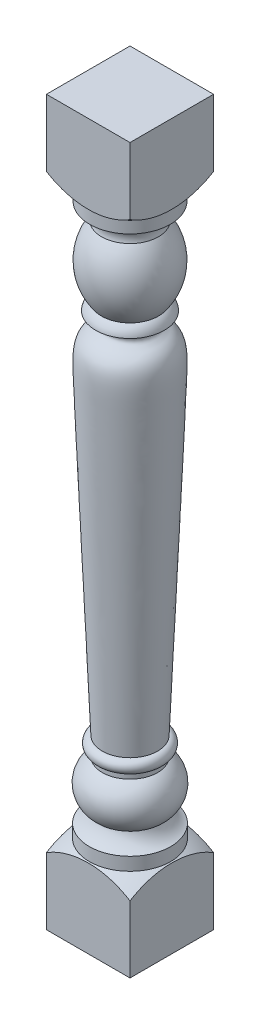
ISO-10303-21;
HEADER;
FILE_DESCRIPTION(('STEP AP214'),'2;1');
FILE_NAME('part.step','',(''),(''),'','','');
FILE_SCHEMA(('AUTOMOTIVE_DESIGN { 1 0 10303 214 1 1 1 1 }'));
ENDSEC;
DATA;
#1=APPLICATION_CONTEXT('core data for automotive mechanical design processes');
#2=APPLICATION_PROTOCOL_DEFINITION('international standard','automotive_design',2000,#1);
#3=PRODUCT_CONTEXT('',#1,'mechanical');
#4=PRODUCT('Part','Part','',(#3));
#5=PRODUCT_RELATED_PRODUCT_CATEGORY('part','',(#4));
#6=PRODUCT_DEFINITION_FORMATION('','',#4);
#7=PRODUCT_DEFINITION_CONTEXT('part definition',#1,'design');
#8=PRODUCT_DEFINITION('design','',#6,#7);
#9=PRODUCT_DEFINITION_SHAPE('','',#8);
#10=(LENGTH_UNIT() NAMED_UNIT(*) SI_UNIT(.MILLI.,.METRE.));
#11=(NAMED_UNIT(*) PLANE_ANGLE_UNIT() SI_UNIT($,.RADIAN.));
#12=(NAMED_UNIT(*) SI_UNIT($,.STERADIAN.) SOLID_ANGLE_UNIT());
#13=UNCERTAINTY_MEASURE_WITH_UNIT(LENGTH_MEASURE(1.E-05),#10,'distance_accuracy_value','');
#14=(GEOMETRIC_REPRESENTATION_CONTEXT(3) GLOBAL_UNCERTAINTY_ASSIGNED_CONTEXT((#13)) GLOBAL_UNIT_ASSIGNED_CONTEXT((#10,
#11,#12)) REPRESENTATION_CONTEXT('',''));
#15=CARTESIAN_POINT('',(0.,0.,0.));
#16=DIRECTION('',(0.,0.,1.));
#17=DIRECTION('',(1.,0.,0.));
#18=AXIS2_PLACEMENT_3D('',#15,#16,#17);
#19=CARTESIAN_POINT('',(28.575,440.454839025049,0.));
#20=DIRECTION('',(0.,-1.,0.));
#21=DIRECTION('',(-1.,0.,0.));
#22=AXIS2_PLACEMENT_3D('',#19,#20,#21);
#23=SPHERICAL_SURFACE('',#22,60.96);
#24=CARTESIAN_POINT('',(28.575,386.08,0.));
#25=DIRECTION('',(0.,-1.,0.));
#26=DIRECTION('',(0.,0.,-1.));
#27=AXIS2_PLACEMENT_3D('',#24,#25,#26);
#28=CIRCLE('',#27,27.559);
#29=CARTESIAN_POINT('',(28.575,386.08,-27.559));
#30=VERTEX_POINT('',#29);
#31=EDGE_CURVE('E225',#30,#30,#28,.T.);
#32=ORIENTED_EDGE('',*,*,#31,.F.);
#33=EDGE_LOOP('',(#32));
#34=FACE_BOUND('',#33,.T.);
#35=CARTESIAN_POINT('',(0.,440.454839025049,0.));
#36=DIRECTION('',(-1.,0.,0.));
#37=DIRECTION('',(0.,0.,1.));
#38=AXIS2_PLACEMENT_3D('',#35,#36,#37);
#39=CIRCLE('',#38,53.8478502356408);
#40=CARTESIAN_POINT('',(0.,394.81428304684,-28.575));
#41=VERTEX_POINT('',#40);
#42=CARTESIAN_POINT('',(0.,394.81428304684,28.575));
#43=VERTEX_POINT('',#42);
#44=EDGE_CURVE('E108',#41,#43,#39,.T.);
#45=ORIENTED_EDGE('',*,*,#44,.F.);
#46=CARTESIAN_POINT('',(28.575,440.454839025049,-28.575));
#47=DIRECTION('',(0.,0.,-1.));
#48=DIRECTION('',(-1.,0.,0.));
#49=AXIS2_PLACEMENT_3D('',#46,#47,#48);
#50=CIRCLE('',#49,53.8478502356408);
#51=CARTESIAN_POINT('',(57.15,394.81428304684,-28.575));
#52=VERTEX_POINT('',#51);
#53=EDGE_CURVE('E150',#52,#41,#50,.T.);
#54=ORIENTED_EDGE('',*,*,#53,.F.);
#55=CARTESIAN_POINT('',(57.15,440.454839025049,0.));
#56=DIRECTION('',(1.,0.,0.));
#57=DIRECTION('',(0.,0.,-1.));
#58=AXIS2_PLACEMENT_3D('',#55,#56,#57);
#59=CIRCLE('',#58,53.8478502356408);
#60=CARTESIAN_POINT('',(57.15,394.81428304684,28.575));
#61=VERTEX_POINT('',#60);
#62=EDGE_CURVE('E148',#61,#52,#59,.T.);
#63=ORIENTED_EDGE('',*,*,#62,.F.);
#64=CARTESIAN_POINT('',(28.575,440.454839025049,28.575));
#65=DIRECTION('',(0.,0.,1.));
#66=DIRECTION('',(1.,0.,0.));
#67=AXIS2_PLACEMENT_3D('',#64,#65,#66);
#68=CIRCLE('',#67,53.8478502356408);
#69=EDGE_CURVE('E139',#43,#61,#68,.T.);
#70=ORIENTED_EDGE('',*,*,#69,.F.);
#71=EDGE_LOOP('',(#45,#54,#63,#70));
#72=FACE_BOUND('',#71,.T.);
#73=ADVANCED_FACE('F34',(#34,#72),#23,.T.);
#74=CARTESIAN_POINT('',(28.575,-54.2453558472981,0.));
#75=DIRECTION('',(0.,-1.,0.));
#76=DIRECTION('',(-1.,0.,0.));
#77=AXIS2_PLACEMENT_3D('',#74,#75,#76);
#78=SPHERICAL_SURFACE('',#77,60.96);
#79=CARTESIAN_POINT('',(28.575,0.,0.));
#80=DIRECTION('',(0.,-1.,0.));
#81=DIRECTION('',(0.,0.,-1.));
#82=AXIS2_PLACEMENT_3D('',#79,#80,#81);
#83=CIRCLE('',#82,27.813);
#84=CARTESIAN_POINT('',(28.575,0.,-27.813));
#85=VERTEX_POINT('',#84);
#86=EDGE_CURVE('E153',#85,#85,#83,.T.);
#87=ORIENTED_EDGE('',*,*,#86,.T.);
#88=EDGE_LOOP('',(#87));
#89=FACE_BOUND('',#88,.T.);
#90=CARTESIAN_POINT('',(0.,-54.2453558472981,0.));
#91=DIRECTION('',(-1.,0.,0.));
#92=DIRECTION('',(0.,0.,1.));
#93=AXIS2_PLACEMENT_3D('',#90,#91,#92);
#94=CIRCLE('',#93,53.8478502356408);
#95=CARTESIAN_POINT('',(0.,-8.60479986908943,28.575));
#96=VERTEX_POINT('',#95);
#97=CARTESIAN_POINT('',(0.,-8.60479986908943,-28.575));
#98=VERTEX_POINT('',#97);
#99=EDGE_CURVE('E12',#96,#98,#94,.T.);
#100=ORIENTED_EDGE('',*,*,#99,.F.);
#101=CARTESIAN_POINT('',(28.575,-54.2453558472981,28.575));
#102=DIRECTION('',(0.,0.,1.));
#103=DIRECTION('',(1.,0.,0.));
#104=AXIS2_PLACEMENT_3D('',#101,#102,#103);
#105=CIRCLE('',#104,53.8478502356408);
#106=CARTESIAN_POINT('',(57.15,-8.60479986908941,28.575));
#107=VERTEX_POINT('',#106);
#108=EDGE_CURVE('E218',#107,#96,#105,.T.);
#109=ORIENTED_EDGE('',*,*,#108,.F.);
#110=CARTESIAN_POINT('',(57.15,-54.2453558472981,0.));
#111=DIRECTION('',(1.,0.,0.));
#112=DIRECTION('',(0.,0.,-1.));
#113=AXIS2_PLACEMENT_3D('',#110,#111,#112);
#114=CIRCLE('',#113,53.8478502356408);
#115=CARTESIAN_POINT('',(57.15,-8.60479986908941,-28.575));
#116=VERTEX_POINT('',#115);
#117=EDGE_CURVE('E224',#116,#107,#114,.T.);
#118=ORIENTED_EDGE('',*,*,#117,.F.);
#119=CARTESIAN_POINT('',(28.575,-54.2453558472981,-28.575));
#120=DIRECTION('',(0.,0.,-1.));
#121=DIRECTION('',(-1.,0.,0.));
#122=AXIS2_PLACEMENT_3D('',#119,#120,#121);
#123=CIRCLE('',#122,53.8478502356408);
#124=EDGE_CURVE('E42',#98,#116,#123,.T.);
#125=ORIENTED_EDGE('',*,*,#124,.F.);
#126=EDGE_LOOP('',(#100,#109,#118,#125));
#127=FACE_BOUND('',#126,.T.);
#128=ADVANCED_FACE('F185',(#89,#127),#78,.T.);
#129=CARTESIAN_POINT('',(28.575,-54.2453558472981,0.));
#130=DIRECTION('',(0.,-1.,0.));
#131=DIRECTION('',(0.,0.,-1.));
#132=AXIS2_PLACEMENT_3D('',#129,#130,#131);
#133=CYLINDRICAL_SURFACE('',#132,27.559);
#134=CARTESIAN_POINT('',(28.575,377.19,0.));
#135=DIRECTION('',(0.,-1.,0.));
#136=DIRECTION('',(0.,0.,-1.));
#137=AXIS2_PLACEMENT_3D('',#134,#135,#136);
#138=CIRCLE('',#137,27.559);
#139=CARTESIAN_POINT('',(28.575,377.19,-27.559));
#140=VERTEX_POINT('',#139);
#141=EDGE_CURVE('E234',#140,#140,#138,.T.);
#142=ORIENTED_EDGE('',*,*,#141,.F.);
#143=EDGE_LOOP('',(#142));
#144=FACE_BOUND('',#143,.T.);
#145=ORIENTED_EDGE('',*,*,#31,.T.);
#146=EDGE_LOOP('',(#145));
#147=FACE_BOUND('',#146,.T.);
#148=ADVANCED_FACE('F181',(#144,#147),#133,.T.);
#149=CARTESIAN_POINT('',(28.575,368.419921422933,0.));
#150=DIRECTION('',(0.,-1.,0.));
#151=DIRECTION('',(0.,0.,-1.));
#152=AXIS2_PLACEMENT_3D('',#149,#150,#151);
#153=TOROIDAL_SURFACE('',#152,27.7912042490007,8.77315205961843);
#154=CARTESIAN_POINT('',(28.575,365.76,0.));
#155=DIRECTION('',(0.,-1.,0.));
#156=DIRECTION('',(0.,0.,-1.));
#157=AXIS2_PLACEMENT_3D('',#154,#155,#156);
#158=CIRCLE('',#157,19.431);
#159=CARTESIAN_POINT('',(28.575,365.76,-19.431));
#160=VERTEX_POINT('',#159);
#161=EDGE_CURVE('E237',#160,#160,#158,.T.);
#162=ORIENTED_EDGE('',*,*,#161,.F.);
#163=EDGE_LOOP('',(#162));
#164=FACE_BOUND('',#163,.T.);
#165=ORIENTED_EDGE('',*,*,#141,.T.);
#166=EDGE_LOOP('',(#165));
#167=FACE_BOUND('',#166,.T.);
#168=ADVANCED_FACE('F177',(#164,#167),#153,.F.);
#169=CARTESIAN_POINT('',(28.575,342.265,0.));
#170=DIRECTION('',(0.,-1.,0.));
#171=DIRECTION('',(0.,0.,-1.));
#172=AXIS2_PLACEMENT_3D('',#169,#170,#171);
#173=DEGENERATE_TOROIDAL_SURFACE('',#172,10.4626171875,38.0216171875,.F.);
#174=CARTESIAN_POINT('',(28.575,318.77,0.));
#175=DIRECTION('',(0.,-1.,0.));
#176=DIRECTION('',(0.,0.,-1.));
#177=AXIS2_PLACEMENT_3D('',#174,#175,#176);
#178=CIRCLE('',#177,19.431);
#179=CARTESIAN_POINT('',(28.575,318.77,-19.431));
#180=VERTEX_POINT('',#179);
#181=EDGE_CURVE('E240',#180,#180,#178,.T.);
#182=ORIENTED_EDGE('',*,*,#181,.F.);
#183=EDGE_LOOP('',(#182));
#184=FACE_BOUND('',#183,.T.);
#185=ORIENTED_EDGE('',*,*,#161,.T.);
#186=EDGE_LOOP('',(#185));
#187=FACE_BOUND('',#186,.T.);
#188=ADVANCED_FACE('F173',(#184,#187),#173,.F.);
#189=CARTESIAN_POINT('',(28.575,310.959588443046,0.));
#190=DIRECTION('',(0.,-1.,0.));
#191=DIRECTION('',(0.,0.,-1.));
#192=AXIS2_PLACEMENT_3D('',#189,#190,#191);
#193=TOROIDAL_SURFACE('',#192,14.2201694422586,9.38910452548592);
#194=CARTESIAN_POINT('',(28.575,312.42,0.));
#195=DIRECTION('',(0.,-1.,0.));
#196=DIRECTION('',(0.,0.,-1.));
#197=AXIS2_PLACEMENT_3D('',#194,#195,#196);
#198=CIRCLE('',#197,23.495);
#199=CARTESIAN_POINT('',(28.575,312.42,-23.495));
#200=VERTEX_POINT('',#199);
#201=EDGE_CURVE('E243',#200,#200,#198,.T.);
#202=ORIENTED_EDGE('',*,*,#201,.F.);
#203=EDGE_LOOP('',(#202));
#204=FACE_BOUND('',#203,.T.);
#205=ORIENTED_EDGE('',*,*,#181,.T.);
#206=EDGE_LOOP('',(#205));
#207=FACE_BOUND('',#206,.T.);
#208=ADVANCED_FACE('F168',(#204,#207),#193,.T.);
#209=CARTESIAN_POINT('',(5.08,312.42,0.));
#210=CARTESIAN_POINT('',(11.4173104349946,311.284997649983,0.));
#211=CARTESIAN_POINT('',(17.3025091797406,300.276086085036,0.));
#212=CARTESIAN_POINT('',(-0.0140903200730887,303.205135197512,0.));
#213=CARTESIAN_POINT('',(2.6345277204096,233.901475667216,0.));
#214=CARTESIAN_POINT('',(1.87324470973118,250.606936673313,0.));
#215=CARTESIAN_POINT('',(9.65200000000001,60.9599999999998,0.));
#216=B_SPLINE_CURVE_WITH_KNOTS('',3,(#209,#210,#211,#212,#213,#214,#215),.UNSPECIFIED.,.F.,.F.,
(4,1,1,1,4),(0.,0.117084259686259,0.342939455018495,0.431231029049869,1.),.UNSPECIFIED.);
#217=CARTESIAN_POINT('',(28.575,-54.2453558472981,0.));
#218=DIRECTION('',(0.,-1.,0.));
#219=AXIS1_PLACEMENT('',#217,#218);
#220=SURFACE_OF_REVOLUTION('',#216,#219);
#221=CARTESIAN_POINT('',(28.575,60.9599999999998,0.));
#222=DIRECTION('',(0.,-1.,0.));
#223=DIRECTION('',(0.,0.,-1.));
#224=AXIS2_PLACEMENT_3D('',#221,#222,#223);
#225=CIRCLE('',#224,18.923);
#226=CARTESIAN_POINT('',(28.575,60.9599999999998,-18.923));
#227=VERTEX_POINT('',#226);
#228=EDGE_CURVE('E246',#227,#227,#225,.T.);
#229=ORIENTED_EDGE('',*,*,#228,.F.);
#230=EDGE_LOOP('',(#229));
#231=FACE_BOUND('',#230,.T.);
#232=ORIENTED_EDGE('',*,*,#201,.T.);
#233=EDGE_LOOP('',(#232));
#234=FACE_BOUND('',#233,.T.);
#235=ADVANCED_FACE('F163',(#231,#234),#220,.T.);
#236=CARTESIAN_POINT('',(28.575,56.515,0.));
#237=DIRECTION('',(0.,-1.,0.));
#238=DIRECTION('',(0.,0.,-1.));
#239=AXIS2_PLACEMENT_3D('',#236,#237,#238);
#240=TOROIDAL_SURFACE('',#239,18.524140625,4.462859375);
#241=CARTESIAN_POINT('',(28.575,52.07,0.));
#242=DIRECTION('',(0.,-1.,0.));
#243=DIRECTION('',(0.,0.,-1.));
#244=AXIS2_PLACEMENT_3D('',#241,#242,#243);
#245=CIRCLE('',#244,18.923);
#246=CARTESIAN_POINT('',(28.575,52.07,-18.923));
#247=VERTEX_POINT('',#246);
#248=EDGE_CURVE('E249',#247,#247,#245,.T.);
#249=ORIENTED_EDGE('',*,*,#248,.F.);
#250=EDGE_LOOP('',(#249));
#251=FACE_BOUND('',#250,.T.);
#252=ORIENTED_EDGE('',*,*,#228,.T.);
#253=EDGE_LOOP('',(#252));
#254=FACE_BOUND('',#253,.T.);
#255=ADVANCED_FACE('F167',(#251,#254),#240,.T.);
#256=CARTESIAN_POINT('',(28.575,-54.2453558472981,0.));
#257=DIRECTION('',(0.,-1.,0.));
#258=DIRECTION('',(0.,0.,-1.));
#259=AXIS2_PLACEMENT_3D('',#256,#257,#258);
#260=CYLINDRICAL_SURFACE('',#259,18.923);
#261=CARTESIAN_POINT('',(28.575,48.26,0.));
#262=DIRECTION('',(0.,-1.,0.));
#263=DIRECTION('',(0.,0.,-1.));
#264=AXIS2_PLACEMENT_3D('',#261,#262,#263);
#265=CIRCLE('',#264,18.923);
#266=CARTESIAN_POINT('',(28.575,48.26,-18.923));
#267=VERTEX_POINT('',#266);
#268=EDGE_CURVE('E252',#267,#267,#265,.T.);
#269=ORIENTED_EDGE('',*,*,#268,.F.);
#270=EDGE_LOOP('',(#269));
#271=FACE_BOUND('',#270,.T.);
#272=ORIENTED_EDGE('',*,*,#248,.T.);
#273=EDGE_LOOP('',(#272));
#274=FACE_BOUND('',#273,.T.);
#275=ADVANCED_FACE('F274',(#271,#274),#260,.T.);
#276=CARTESIAN_POINT('',(28.575,32.8741223177209,0.));
#277=DIRECTION('',(0.,-1.,0.));
#278=DIRECTION('',(0.,0.,-1.));
#279=AXIS2_PLACEMENT_3D('',#276,#277,#278);
#280=DEGENERATE_TOROIDAL_SURFACE('',#279,10.4243390632545,17.5770438291488,.T.);
#281=CARTESIAN_POINT('',(28.575,17.78,0.));
#282=DIRECTION('',(0.,-1.,0.));
#283=DIRECTION('',(0.,0.,-1.));
#284=AXIS2_PLACEMENT_3D('',#281,#282,#283);
#285=CIRCLE('',#284,19.431);
#286=CARTESIAN_POINT('',(28.575,17.78,-19.431));
#287=VERTEX_POINT('',#286);
#288=EDGE_CURVE('E255',#287,#287,#285,.T.);
#289=ORIENTED_EDGE('',*,*,#288,.F.);
#290=EDGE_LOOP('',(#289));
#291=FACE_BOUND('',#290,.T.);
#292=ORIENTED_EDGE('',*,*,#268,.T.);
#293=EDGE_LOOP('',(#292));
#294=FACE_BOUND('',#293,.T.);
#295=ADVANCED_FACE('F271',(#291,#294),#280,.T.);
#296=CARTESIAN_POINT('',(28.575,22.6790439713901,0.));
#297=DIRECTION('',(0.,-1.,0.));
#298=DIRECTION('',(0.,0.,-1.));
#299=AXIS2_PLACEMENT_3D('',#296,#297,#298);
#300=TOROIDAL_SURFACE('',#299,33.5323496666258,14.9281175723553);
#301=CARTESIAN_POINT('',(28.575,8.89,0.));
#302=DIRECTION('',(0.,-1.,0.));
#303=DIRECTION('',(0.,0.,-1.));
#304=AXIS2_PLACEMENT_3D('',#301,#302,#303);
#305=CIRCLE('',#304,27.813);
#306=CARTESIAN_POINT('',(28.575,8.89,-27.813));
#307=VERTEX_POINT('',#306);
#308=EDGE_CURVE('E257',#307,#307,#305,.T.);
#309=ORIENTED_EDGE('',*,*,#308,.F.);
#310=EDGE_LOOP('',(#309));
#311=FACE_BOUND('',#310,.T.);
#312=ORIENTED_EDGE('',*,*,#288,.T.);
#313=EDGE_LOOP('',(#312));
#314=FACE_BOUND('',#313,.T.);
#315=ADVANCED_FACE('F214',(#311,#314),#300,.F.);
#316=CARTESIAN_POINT('',(28.575,-54.2453558472981,0.));
#317=DIRECTION('',(0.,-1.,0.));
#318=DIRECTION('',(0.,0.,-1.));
#319=AXIS2_PLACEMENT_3D('',#316,#317,#318);
#320=CYLINDRICAL_SURFACE('',#319,27.813);
#321=ORIENTED_EDGE('',*,*,#86,.F.);
#322=EDGE_LOOP('',(#321));
#323=FACE_BOUND('',#322,.T.);
#324=ORIENTED_EDGE('',*,*,#308,.T.);
#325=EDGE_LOOP('',(#324));
#326=FACE_BOUND('',#325,.T.);
#327=ADVANCED_FACE('F206',(#323,#326),#320,.T.);
#328=CARTESIAN_POINT('',(0.,-54.2453558472981,28.575));
#329=DIRECTION('',(0.,0.,1.));
#330=DIRECTION('',(1.,0.,0.));
#331=AXIS2_PLACEMENT_3D('',#328,#329,#330);
#332=PLANE('',#331);
#333=ORIENTED_EDGE('',*,*,#108,.T.);
#334=DIRECTION('',(0.,1.,0.));
#335=VECTOR('',#334,1.);
#336=CARTESIAN_POINT('',(0.,-54.2453558472981,28.575));
#337=LINE('',#336,#335);
#338=CARTESIAN_POINT('',(0.,-54.2453558472981,28.575));
#339=VERTEX_POINT('',#338);
#340=EDGE_CURVE('E111',#339,#96,#337,.T.);
#341=ORIENTED_EDGE('',*,*,#340,.F.);
#342=DIRECTION('',(1.,0.,0.));
#343=VECTOR('',#342,1.);
#344=CARTESIAN_POINT('',(0.,-54.2453558472981,28.575));
#345=LINE('',#344,#343);
#346=CARTESIAN_POINT('',(57.15,-54.2453558472981,28.575));
#347=VERTEX_POINT('',#346);
#348=EDGE_CURVE('E128',#339,#347,#345,.T.);
#349=ORIENTED_EDGE('',*,*,#348,.T.);
#350=DIRECTION('',(0.,1.,0.));
#351=VECTOR('',#350,1.);
#352=CARTESIAN_POINT('',(57.15,-54.2453558472981,28.575));
#353=LINE('',#352,#351);
#354=EDGE_CURVE('E145',#347,#107,#353,.T.);
#355=ORIENTED_EDGE('',*,*,#354,.T.);
#356=EDGE_LOOP('',(#333,#341,#349,#355));
#357=FACE_BOUND('',#356,.T.);
#358=ADVANCED_FACE('F197',(#357),#332,.T.);
#359=CARTESIAN_POINT('',(57.15,-54.2453558472981,-28.575));
#360=DIRECTION('',(1.,0.,0.));
#361=DIRECTION('',(0.,0.,-1.));
#362=AXIS2_PLACEMENT_3D('',#359,#360,#361);
#363=PLANE('',#362);
#364=ORIENTED_EDGE('',*,*,#117,.T.);
#365=ORIENTED_EDGE('',*,*,#354,.F.);
#366=DIRECTION('',(0.,0.,-1.));
#367=VECTOR('',#366,1.);
#368=CARTESIAN_POINT('',(57.15,-54.2453558472981,-28.575));
#369=LINE('',#368,#367);
#370=CARTESIAN_POINT('',(57.15,-54.2453558472981,-28.575));
#371=VERTEX_POINT('',#370);
#372=EDGE_CURVE('E131',#347,#371,#369,.T.);
#373=ORIENTED_EDGE('',*,*,#372,.T.);
#374=DIRECTION('',(0.,1.,0.));
#375=VECTOR('',#374,1.);
#376=CARTESIAN_POINT('',(57.15,-54.2453558472981,-28.575));
#377=LINE('',#376,#375);
#378=EDGE_CURVE('E141',#371,#116,#377,.T.);
#379=ORIENTED_EDGE('',*,*,#378,.T.);
#380=EDGE_LOOP('',(#364,#365,#373,#379));
#381=FACE_BOUND('',#380,.T.);
#382=ADVANCED_FACE('F203',(#381),#363,.T.);
#383=CARTESIAN_POINT('',(0.,-54.2453558472981,-28.575));
#384=DIRECTION('',(0.,0.,-1.));
#385=DIRECTION('',(-1.,0.,0.));
#386=AXIS2_PLACEMENT_3D('',#383,#384,#385);
#387=PLANE('',#386);
#388=ORIENTED_EDGE('',*,*,#124,.T.);
#389=ORIENTED_EDGE('',*,*,#378,.F.);
#390=DIRECTION('',(-1.,0.,0.));
#391=VECTOR('',#390,1.);
#392=CARTESIAN_POINT('',(0.,-54.2453558472981,-28.575));
#393=LINE('',#392,#391);
#394=CARTESIAN_POINT('',(0.,-54.2453558472981,-28.575));
#395=VERTEX_POINT('',#394);
#396=EDGE_CURVE('E112',#371,#395,#393,.T.);
#397=ORIENTED_EDGE('',*,*,#396,.T.);
#398=DIRECTION('',(0.,1.,0.));
#399=VECTOR('',#398,1.);
#400=CARTESIAN_POINT('',(0.,-54.2453558472981,-28.575));
#401=LINE('',#400,#399);
#402=EDGE_CURVE('E136',#395,#98,#401,.T.);
#403=ORIENTED_EDGE('',*,*,#402,.T.);
#404=EDGE_LOOP('',(#388,#389,#397,#403));
#405=FACE_BOUND('',#404,.T.);
#406=ADVANCED_FACE('F212',(#405),#387,.T.);
#407=CARTESIAN_POINT('',(0.,-54.2453558472981,-28.575));
#408=DIRECTION('',(-1.,0.,0.));
#409=DIRECTION('',(0.,0.,1.));
#410=AXIS2_PLACEMENT_3D('',#407,#408,#409);
#411=PLANE('',#410);
#412=ORIENTED_EDGE('',*,*,#99,.T.);
#413=ORIENTED_EDGE('',*,*,#402,.F.);
#414=DIRECTION('',(0.,0.,1.));
#415=VECTOR('',#414,1.);
#416=CARTESIAN_POINT('',(0.,-54.2453558472981,-28.575));
#417=LINE('',#416,#415);
#418=EDGE_CURVE('E49',#395,#339,#417,.T.);
#419=ORIENTED_EDGE('',*,*,#418,.T.);
#420=ORIENTED_EDGE('',*,*,#340,.T.);
#421=EDGE_LOOP('',(#412,#413,#419,#420));
#422=FACE_BOUND('',#421,.T.);
#423=ADVANCED_FACE('F227',(#422),#411,.T.);
#424=ORIENTED_EDGE('',*,*,#44,.T.);
#425=CARTESIAN_POINT('',(0.,440.454839025049,28.575));
#426=VERTEX_POINT('',#425);
#427=EDGE_CURVE('E100',#43,#426,#337,.T.);
#428=ORIENTED_EDGE('',*,*,#427,.T.);
#429=DIRECTION('',(0.,0.,1.));
#430=VECTOR('',#429,1.);
#431=CARTESIAN_POINT('',(0.,440.454839025049,-28.575));
#432=LINE('',#431,#430);
#433=CARTESIAN_POINT('',(0.,440.454839025049,-28.575));
#434=VERTEX_POINT('',#433);
#435=EDGE_CURVE('E105',#434,#426,#432,.T.);
#436=ORIENTED_EDGE('',*,*,#435,.F.);
#437=EDGE_CURVE('E140',#41,#434,#401,.T.);
#438=ORIENTED_EDGE('',*,*,#437,.F.);
#439=EDGE_LOOP('',(#424,#428,#436,#438));
#440=FACE_BOUND('',#439,.T.);
#441=ADVANCED_FACE('F102',(#440),#411,.T.);
#442=ORIENTED_EDGE('',*,*,#53,.T.);
#443=ORIENTED_EDGE('',*,*,#437,.T.);
#444=DIRECTION('',(-1.,0.,0.));
#445=VECTOR('',#444,1.);
#446=CARTESIAN_POINT('',(0.,440.454839025049,-28.575));
#447=LINE('',#446,#445);
#448=CARTESIAN_POINT('',(57.15,440.454839025049,-28.575));
#449=VERTEX_POINT('',#448);
#450=EDGE_CURVE('E122',#449,#434,#447,.T.);
#451=ORIENTED_EDGE('',*,*,#450,.F.);
#452=EDGE_CURVE('E144',#52,#449,#377,.T.);
#453=ORIENTED_EDGE('',*,*,#452,.F.);
#454=EDGE_LOOP('',(#442,#443,#451,#453));
#455=FACE_BOUND('',#454,.T.);
#456=ADVANCED_FACE('F201',(#455),#387,.T.);
#457=ORIENTED_EDGE('',*,*,#62,.T.);
#458=ORIENTED_EDGE('',*,*,#452,.T.);
#459=DIRECTION('',(0.,0.,-1.));
#460=VECTOR('',#459,1.);
#461=CARTESIAN_POINT('',(57.15,440.454839025049,-28.575));
#462=LINE('',#461,#460);
#463=CARTESIAN_POINT('',(57.15,440.454839025049,28.575));
#464=VERTEX_POINT('',#463);
#465=EDGE_CURVE('E57',#464,#449,#462,.T.);
#466=ORIENTED_EDGE('',*,*,#465,.F.);
#467=EDGE_CURVE('E117',#61,#464,#353,.T.);
#468=ORIENTED_EDGE('',*,*,#467,.F.);
#469=EDGE_LOOP('',(#457,#458,#466,#468));
#470=FACE_BOUND('',#469,.T.);
#471=ADVANCED_FACE('F195',(#470),#363,.T.);
#472=ORIENTED_EDGE('',*,*,#69,.T.);
#473=ORIENTED_EDGE('',*,*,#467,.T.);
#474=DIRECTION('',(1.,0.,0.));
#475=VECTOR('',#474,1.);
#476=CARTESIAN_POINT('',(0.,440.454839025049,28.575));
#477=LINE('',#476,#475);
#478=EDGE_CURVE('E115',#426,#464,#477,.T.);
#479=ORIENTED_EDGE('',*,*,#478,.F.);
#480=ORIENTED_EDGE('',*,*,#427,.F.);
#481=EDGE_LOOP('',(#472,#473,#479,#480));
#482=FACE_BOUND('',#481,.T.);
#483=ADVANCED_FACE('F116',(#482),#332,.T.);
#484=CARTESIAN_POINT('',(-32.385,440.454839025049,0.));
#485=DIRECTION('',(0.,-1.,0.));
#486=DIRECTION('',(0.,0.,-1.));
#487=AXIS2_PLACEMENT_3D('',#484,#485,#486);
#488=PLANE('',#487);
#489=ORIENTED_EDGE('',*,*,#435,.T.);
#490=ORIENTED_EDGE('',*,*,#478,.T.);
#491=ORIENTED_EDGE('',*,*,#465,.T.);
#492=ORIENTED_EDGE('',*,*,#450,.T.);
#493=EDGE_LOOP('',(#489,#490,#491,#492));
#494=FACE_BOUND('',#493,.T.);
#495=ADVANCED_FACE('F120',(#494),#488,.F.);
#496=CARTESIAN_POINT('',(0.,-54.2453558472981,0.));
#497=DIRECTION('',(0.,1.,0.));
#498=DIRECTION('',(0.,0.,1.));
#499=AXIS2_PLACEMENT_3D('',#496,#497,#498);
#500=PLANE('',#499);
#501=ORIENTED_EDGE('',*,*,#418,.F.);
#502=ORIENTED_EDGE('',*,*,#396,.F.);
#503=ORIENTED_EDGE('',*,*,#372,.F.);
#504=ORIENTED_EDGE('',*,*,#348,.F.);
#505=EDGE_LOOP('',(#501,#502,#503,#504));
#506=FACE_BOUND('',#505,.T.);
#507=ADVANCED_FACE('F36',(#506),#500,.F.);
#508=CLOSED_SHELL('',(#73,#128,#148,#168,#188,#208,#235,#255,#275,#295,#315,#327,#358,#382,#406,
#423,#441,#456,#471,#483,#495,#507));
#509=MANIFOLD_SOLID_BREP('B2',#508);
#510=ADVANCED_BREP_SHAPE_REPRESENTATION('',(#18,#509),#14);
#511=SHAPE_DEFINITION_REPRESENTATION(#9,#510);
ENDSEC;
END-ISO-10303-21;
